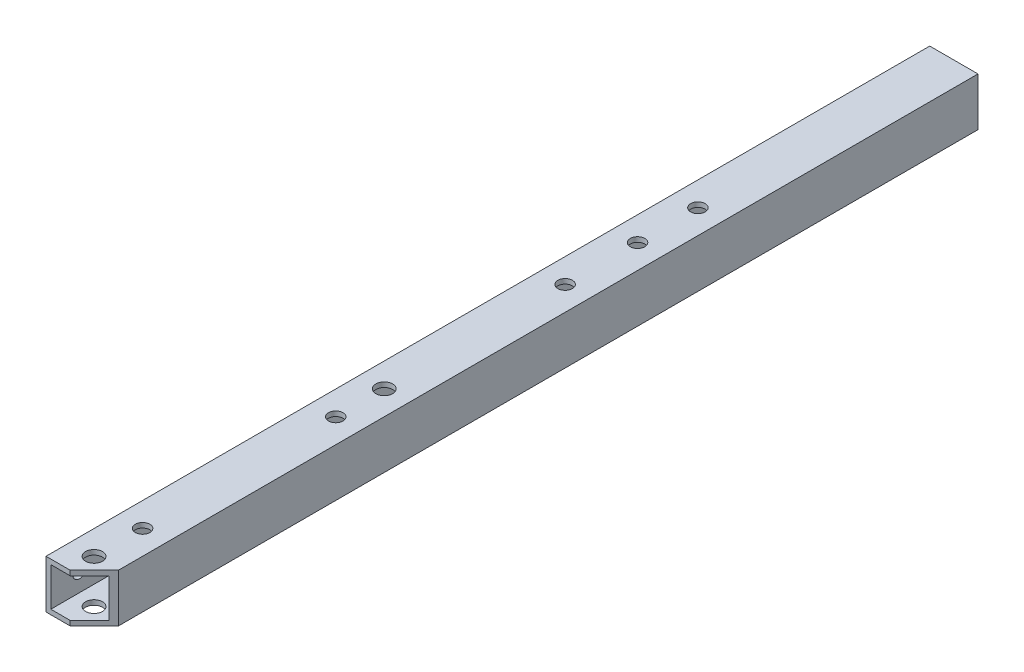
ISO-10303-21;
HEADER;
FILE_DESCRIPTION(('STEP AP214'),'2;1');
FILE_NAME('part.step','',(''),(''),'','','');
FILE_SCHEMA(('AUTOMOTIVE_DESIGN { 1 0 10303 214 1 1 1 1 }'));
ENDSEC;
DATA;
#1=APPLICATION_CONTEXT('core data for automotive mechanical design processes');
#2=APPLICATION_PROTOCOL_DEFINITION('international standard','automotive_design',2000,#1);
#3=PRODUCT_CONTEXT('',#1,'mechanical');
#4=PRODUCT('Part','Part','',(#3));
#5=PRODUCT_RELATED_PRODUCT_CATEGORY('part','',(#4));
#6=PRODUCT_DEFINITION_FORMATION('','',#4);
#7=PRODUCT_DEFINITION_CONTEXT('part definition',#1,'design');
#8=PRODUCT_DEFINITION('design','',#6,#7);
#9=PRODUCT_DEFINITION_SHAPE('','',#8);
#10=(LENGTH_UNIT() NAMED_UNIT(*) SI_UNIT(.MILLI.,.METRE.));
#11=(NAMED_UNIT(*) PLANE_ANGLE_UNIT() SI_UNIT($,.RADIAN.));
#12=(NAMED_UNIT(*) SI_UNIT($,.STERADIAN.) SOLID_ANGLE_UNIT());
#13=UNCERTAINTY_MEASURE_WITH_UNIT(LENGTH_MEASURE(1.E-05),#10,'distance_accuracy_value','');
#14=(GEOMETRIC_REPRESENTATION_CONTEXT(3) GLOBAL_UNCERTAINTY_ASSIGNED_CONTEXT((#13)) GLOBAL_UNIT_ASSIGNED_CONTEXT((#10,
#11,#12)) REPRESENTATION_CONTEXT('',''));
#15=CARTESIAN_POINT('',(0.,0.,0.));
#16=DIRECTION('',(0.,0.,1.));
#17=DIRECTION('',(1.,0.,0.));
#18=AXIS2_PLACEMENT_3D('',#15,#16,#17);
#19=CARTESIAN_POINT('',(-5.,-5.,183.));
#20=DIRECTION('',(0.,1.,0.));
#21=DIRECTION('',(0.,0.,1.));
#22=AXIS2_PLACEMENT_3D('',#19,#20,#21);
#23=PLANE('',#22);
#24=CARTESIAN_POINT('',(0.,-5.,53.));
#25=DIRECTION('',(0.,1.,0.));
#26=DIRECTION('',(0.,0.,1.));
#27=AXIS2_PLACEMENT_3D('',#24,#25,#26);
#28=CIRCLE('',#27,1.5);
#29=CARTESIAN_POINT('',(0.,-5.,54.5));
#30=VERTEX_POINT('',#29);
#31=EDGE_CURVE('E361',#30,#30,#28,.T.);
#32=ORIENTED_EDGE('',*,*,#31,.T.);
#33=EDGE_LOOP('',(#32));
#34=FACE_BOUND('',#33,.T.);
#35=CARTESIAN_POINT('',(0.,-5.,65.5));
#36=DIRECTION('',(0.,1.,0.));
#37=DIRECTION('',(0.,0.,1.));
#38=AXIS2_PLACEMENT_3D('',#35,#36,#37);
#39=CIRCLE('',#38,1.5);
#40=CARTESIAN_POINT('',(0.,-5.,67.));
#41=VERTEX_POINT('',#40);
#42=EDGE_CURVE('E355',#41,#41,#39,.T.);
#43=ORIENTED_EDGE('',*,*,#42,.T.);
#44=EDGE_LOOP('',(#43));
#45=FACE_BOUND('',#44,.T.);
#46=CARTESIAN_POINT('',(0.,-5.,80.5));
#47=DIRECTION('',(0.,1.,0.));
#48=DIRECTION('',(0.,0.,1.));
#49=AXIS2_PLACEMENT_3D('',#46,#47,#48);
#50=CIRCLE('',#49,1.5);
#51=CARTESIAN_POINT('',(0.,-5.,82.));
#52=VERTEX_POINT('',#51);
#53=EDGE_CURVE('E349',#52,#52,#50,.T.);
#54=ORIENTED_EDGE('',*,*,#53,.T.);
#55=EDGE_LOOP('',(#54));
#56=FACE_BOUND('',#55,.T.);
#57=CARTESIAN_POINT('',(0.,-5.,117.947961799572));
#58=DIRECTION('',(0.,1.,0.));
#59=DIRECTION('',(0.,0.,1.));
#60=AXIS2_PLACEMENT_3D('',#57,#58,#59);
#61=CIRCLE('',#60,1.75000000000001);
#62=CARTESIAN_POINT('',(0.,-5.,119.697961799572));
#63=VERTEX_POINT('',#62);
#64=EDGE_CURVE('E343',#63,#63,#61,.T.);
#65=ORIENTED_EDGE('',*,*,#64,.T.);
#66=EDGE_LOOP('',(#65));
#67=FACE_BOUND('',#66,.T.);
#68=CARTESIAN_POINT('',(0.,-5.,128.));
#69=DIRECTION('',(0.,1.,0.));
#70=DIRECTION('',(0.,0.,1.));
#71=AXIS2_PLACEMENT_3D('',#68,#69,#70);
#72=CIRCLE('',#71,1.5);
#73=CARTESIAN_POINT('',(0.,-5.,129.5));
#74=VERTEX_POINT('',#73);
#75=EDGE_CURVE('E335',#74,#74,#72,.T.);
#76=ORIENTED_EDGE('',*,*,#75,.T.);
#77=EDGE_LOOP('',(#76));
#78=FACE_BOUND('',#77,.T.);
#79=DIRECTION('',(0.,0.,-1.));
#80=VECTOR('',#79,1.);
#81=CARTESIAN_POINT('',(4.99999999999999,-5.,183.));
#82=LINE('',#81,#80);
#83=CARTESIAN_POINT('',(4.99999999999999,-5.,178.));
#84=VERTEX_POINT('',#83);
#85=CARTESIAN_POINT('',(4.99999999999999,-5.,0.));
#86=VERTEX_POINT('',#85);
#87=EDGE_CURVE('E174',#84,#86,#82,.T.);
#88=ORIENTED_EDGE('',*,*,#87,.F.);
#89=DIRECTION('',(-0.707106781186547,0.,0.707106781186549));
#90=VECTOR('',#89,1.);
#91=CARTESIAN_POINT('',(91.5,-5.,91.4999999999997));
#92=LINE('',#91,#90);
#93=CARTESIAN_POINT('',(0.,-5.,183.));
#94=VERTEX_POINT('',#93);
#95=EDGE_CURVE('E158',#84,#94,#92,.T.);
#96=ORIENTED_EDGE('',*,*,#95,.T.);
#97=DIRECTION('',(1.,0.,0.));
#98=VECTOR('',#97,1.);
#99=CARTESIAN_POINT('',(-5.,-5.,183.));
#100=LINE('',#99,#98);
#101=CARTESIAN_POINT('',(-5.,-5.,183.));
#102=VERTEX_POINT('',#101);
#103=EDGE_CURVE('E255',#102,#94,#100,.T.);
#104=ORIENTED_EDGE('',*,*,#103,.F.);
#105=DIRECTION('',(0.,0.,-1.));
#106=VECTOR('',#105,1.);
#107=CARTESIAN_POINT('',(-5.,-5.,183.));
#108=LINE('',#107,#106);
#109=CARTESIAN_POINT('',(-5.,-5.,0.));
#110=VERTEX_POINT('',#109);
#111=EDGE_CURVE('E89',#102,#110,#108,.T.);
#112=ORIENTED_EDGE('',*,*,#111,.T.);
#113=DIRECTION('',(1.,0.,0.));
#114=VECTOR('',#113,1.);
#115=CARTESIAN_POINT('',(-5.,-5.,0.));
#116=LINE('',#115,#114);
#117=EDGE_CURVE('E180',#110,#86,#116,.T.);
#118=ORIENTED_EDGE('',*,*,#117,.T.);
#119=EDGE_LOOP('',(#88,#96,#104,#112,#118));
#120=FACE_BOUND('',#119,.T.);
#121=CARTESIAN_POINT('',(0.,-5.,178.052038200428));
#122=DIRECTION('',(0.,1.,0.));
#123=DIRECTION('',(0.,0.,1.));
#124=AXIS2_PLACEMENT_3D('',#121,#122,#123);
#125=CIRCLE('',#124,1.75000000000001);
#126=CARTESIAN_POINT('',(0.,-5.,179.802038200428));
#127=VERTEX_POINT('',#126);
#128=EDGE_CURVE('E282',#127,#127,#125,.F.);
#129=ORIENTED_EDGE('',*,*,#128,.F.);
#130=EDGE_LOOP('',(#129));
#131=FACE_BOUND('',#130,.T.);
#132=CARTESIAN_POINT('',(0.,-5.,168.));
#133=DIRECTION('',(0.,1.,0.));
#134=DIRECTION('',(0.,0.,1.));
#135=AXIS2_PLACEMENT_3D('',#132,#133,#134);
#136=CIRCLE('',#135,1.5);
#137=CARTESIAN_POINT('',(0.,-5.,169.5));
#138=VERTEX_POINT('',#137);
#139=EDGE_CURVE('E328',#138,#138,#136,.F.);
#140=ORIENTED_EDGE('',*,*,#139,.F.);
#141=EDGE_LOOP('',(#140));
#142=FACE_BOUND('',#141,.T.);
#143=ADVANCED_FACE('F80',(#34,#45,#56,#67,#78,#120,#131,#142),#23,.F.);
#144=CARTESIAN_POINT('',(-5.,5.,183.));
#145=DIRECTION('',(0.,-1.,0.));
#146=DIRECTION('',(0.,0.,-1.));
#147=AXIS2_PLACEMENT_3D('',#144,#145,#146);
#148=PLANE('',#147);
#149=CARTESIAN_POINT('',(0.,5.,53.));
#150=DIRECTION('',(0.,1.,0.));
#151=DIRECTION('',(0.,0.,1.));
#152=AXIS2_PLACEMENT_3D('',#149,#150,#151);
#153=CIRCLE('',#152,1.5);
#154=CARTESIAN_POINT('',(0.,5.,54.5));
#155=VERTEX_POINT('',#154);
#156=EDGE_CURVE('E363',#155,#155,#153,.T.);
#157=ORIENTED_EDGE('',*,*,#156,.F.);
#158=EDGE_LOOP('',(#157));
#159=FACE_BOUND('',#158,.T.);
#160=CARTESIAN_POINT('',(0.,5.,65.5));
#161=DIRECTION('',(0.,1.,0.));
#162=DIRECTION('',(0.,0.,1.));
#163=AXIS2_PLACEMENT_3D('',#160,#161,#162);
#164=CIRCLE('',#163,1.5);
#165=CARTESIAN_POINT('',(0.,5.,67.));
#166=VERTEX_POINT('',#165);
#167=EDGE_CURVE('E358',#166,#166,#164,.T.);
#168=ORIENTED_EDGE('',*,*,#167,.F.);
#169=EDGE_LOOP('',(#168));
#170=FACE_BOUND('',#169,.T.);
#171=CARTESIAN_POINT('',(0.,5.,80.5));
#172=DIRECTION('',(0.,1.,0.));
#173=DIRECTION('',(0.,0.,1.));
#174=AXIS2_PLACEMENT_3D('',#171,#172,#173);
#175=CIRCLE('',#174,1.5);
#176=CARTESIAN_POINT('',(0.,5.,82.));
#177=VERTEX_POINT('',#176);
#178=EDGE_CURVE('E352',#177,#177,#175,.T.);
#179=ORIENTED_EDGE('',*,*,#178,.F.);
#180=EDGE_LOOP('',(#179));
#181=FACE_BOUND('',#180,.T.);
#182=CARTESIAN_POINT('',(0.,5.,117.947961799572));
#183=DIRECTION('',(0.,1.,0.));
#184=DIRECTION('',(0.,0.,1.));
#185=AXIS2_PLACEMENT_3D('',#182,#183,#184);
#186=CIRCLE('',#185,1.75000000000001);
#187=CARTESIAN_POINT('',(0.,5.,119.697961799572));
#188=VERTEX_POINT('',#187);
#189=EDGE_CURVE('E346',#188,#188,#186,.T.);
#190=ORIENTED_EDGE('',*,*,#189,.F.);
#191=EDGE_LOOP('',(#190));
#192=FACE_BOUND('',#191,.T.);
#193=CARTESIAN_POINT('',(0.,5.,128.));
#194=DIRECTION('',(0.,1.,0.));
#195=DIRECTION('',(0.,0.,1.));
#196=AXIS2_PLACEMENT_3D('',#193,#194,#195);
#197=CIRCLE('',#196,1.5);
#198=CARTESIAN_POINT('',(0.,5.,129.5));
#199=VERTEX_POINT('',#198);
#200=EDGE_CURVE('E340',#199,#199,#197,.T.);
#201=ORIENTED_EDGE('',*,*,#200,.F.);
#202=EDGE_LOOP('',(#201));
#203=FACE_BOUND('',#202,.T.);
#204=DIRECTION('',(-1.,0.,0.));
#205=VECTOR('',#204,1.);
#206=CARTESIAN_POINT('',(-5.,5.,183.));
#207=LINE('',#206,#205);
#208=CARTESIAN_POINT('',(0.,5.,183.));
#209=VERTEX_POINT('',#208);
#210=CARTESIAN_POINT('',(-5.,5.,183.));
#211=VERTEX_POINT('',#210);
#212=EDGE_CURVE('E258',#209,#211,#207,.T.);
#213=ORIENTED_EDGE('',*,*,#212,.F.);
#214=DIRECTION('',(-0.707106781186547,0.,0.707106781186549));
#215=VECTOR('',#214,1.);
#216=CARTESIAN_POINT('',(91.5,5.,91.4999999999997));
#217=LINE('',#216,#215);
#218=CARTESIAN_POINT('',(4.99999999999999,5.,178.));
#219=VERTEX_POINT('',#218);
#220=EDGE_CURVE('E168',#219,#209,#217,.T.);
#221=ORIENTED_EDGE('',*,*,#220,.F.);
#222=DIRECTION('',(0.,0.,-1.));
#223=VECTOR('',#222,1.);
#224=CARTESIAN_POINT('',(4.99999999999999,5.,183.));
#225=LINE('',#224,#223);
#226=CARTESIAN_POINT('',(4.99999999999999,5.,0.));
#227=VERTEX_POINT('',#226);
#228=EDGE_CURVE('E176',#219,#227,#225,.T.);
#229=ORIENTED_EDGE('',*,*,#228,.T.);
#230=DIRECTION('',(-1.,0.,0.));
#231=VECTOR('',#230,1.);
#232=CARTESIAN_POINT('',(-5.,5.,0.));
#233=LINE('',#232,#231);
#234=CARTESIAN_POINT('',(-5.,5.,0.));
#235=VERTEX_POINT('',#234);
#236=EDGE_CURVE('E256',#227,#235,#233,.T.);
#237=ORIENTED_EDGE('',*,*,#236,.T.);
#238=DIRECTION('',(0.,0.,-1.));
#239=VECTOR('',#238,1.);
#240=CARTESIAN_POINT('',(-5.,5.,183.));
#241=LINE('',#240,#239);
#242=EDGE_CURVE('E184',#211,#235,#241,.T.);
#243=ORIENTED_EDGE('',*,*,#242,.F.);
#244=EDGE_LOOP('',(#213,#221,#229,#237,#243));
#245=FACE_BOUND('',#244,.T.);
#246=CARTESIAN_POINT('',(0.,5.,178.052038200428));
#247=DIRECTION('',(0.,1.,0.));
#248=DIRECTION('',(0.,0.,1.));
#249=AXIS2_PLACEMENT_3D('',#246,#247,#248);
#250=CIRCLE('',#249,1.75000000000001);
#251=CARTESIAN_POINT('',(0.,5.,179.802038200428));
#252=VERTEX_POINT('',#251);
#253=EDGE_CURVE('E285',#252,#252,#250,.F.);
#254=ORIENTED_EDGE('',*,*,#253,.T.);
#255=EDGE_LOOP('',(#254));
#256=FACE_BOUND('',#255,.T.);
#257=CARTESIAN_POINT('',(0.,5.,168.));
#258=DIRECTION('',(0.,1.,0.));
#259=DIRECTION('',(0.,0.,1.));
#260=AXIS2_PLACEMENT_3D('',#257,#258,#259);
#261=CIRCLE('',#260,1.5);
#262=CARTESIAN_POINT('',(0.,5.,169.5));
#263=VERTEX_POINT('',#262);
#264=EDGE_CURVE('E330',#263,#263,#261,.F.);
#265=ORIENTED_EDGE('',*,*,#264,.T.);
#266=EDGE_LOOP('',(#265));
#267=FACE_BOUND('',#266,.T.);
#268=ADVANCED_FACE('F280',(#159,#170,#181,#192,#203,#245,#256,#267),#148,.F.);
#269=CARTESIAN_POINT('',(-5.,-4.,183.));
#270=DIRECTION('',(0.,1.,0.));
#271=DIRECTION('',(0.,0.,1.));
#272=AXIS2_PLACEMENT_3D('',#269,#270,#271);
#273=PLANE('',#272);
#274=CARTESIAN_POINT('',(0.,-4.,53.));
#275=DIRECTION('',(0.,1.,0.));
#276=DIRECTION('',(0.,0.,1.));
#277=AXIS2_PLACEMENT_3D('',#274,#275,#276);
#278=CIRCLE('',#277,1.5);
#279=CARTESIAN_POINT('',(0.,-4.,54.5));
#280=VERTEX_POINT('',#279);
#281=EDGE_CURVE('E214',#280,#280,#278,.T.);
#282=ORIENTED_EDGE('',*,*,#281,.F.);
#283=EDGE_LOOP('',(#282));
#284=FACE_BOUND('',#283,.T.);
#285=CARTESIAN_POINT('',(0.,-4.,65.5));
#286=DIRECTION('',(0.,1.,0.));
#287=DIRECTION('',(0.,0.,1.));
#288=AXIS2_PLACEMENT_3D('',#285,#286,#287);
#289=CIRCLE('',#288,1.5);
#290=CARTESIAN_POINT('',(0.,-4.,67.));
#291=VERTEX_POINT('',#290);
#292=EDGE_CURVE('E211',#291,#291,#289,.T.);
#293=ORIENTED_EDGE('',*,*,#292,.F.);
#294=EDGE_LOOP('',(#293));
#295=FACE_BOUND('',#294,.T.);
#296=CARTESIAN_POINT('',(0.,-4.,80.5));
#297=DIRECTION('',(0.,1.,0.));
#298=DIRECTION('',(0.,0.,1.));
#299=AXIS2_PLACEMENT_3D('',#296,#297,#298);
#300=CIRCLE('',#299,1.5);
#301=CARTESIAN_POINT('',(0.,-4.,82.));
#302=VERTEX_POINT('',#301);
#303=EDGE_CURVE('E208',#302,#302,#300,.T.);
#304=ORIENTED_EDGE('',*,*,#303,.F.);
#305=EDGE_LOOP('',(#304));
#306=FACE_BOUND('',#305,.T.);
#307=CARTESIAN_POINT('',(0.,-4.,117.947961799572));
#308=DIRECTION('',(0.,1.,0.));
#309=DIRECTION('',(0.,0.,1.));
#310=AXIS2_PLACEMENT_3D('',#307,#308,#309);
#311=CIRCLE('',#310,1.75000000000001);
#312=CARTESIAN_POINT('',(0.,-4.,119.697961799572));
#313=VERTEX_POINT('',#312);
#314=EDGE_CURVE('E204',#313,#313,#311,.T.);
#315=ORIENTED_EDGE('',*,*,#314,.F.);
#316=EDGE_LOOP('',(#315));
#317=FACE_BOUND('',#316,.T.);
#318=CARTESIAN_POINT('',(0.,-4.,128.));
#319=DIRECTION('',(0.,1.,0.));
#320=DIRECTION('',(0.,0.,1.));
#321=AXIS2_PLACEMENT_3D('',#318,#319,#320);
#322=CIRCLE('',#321,1.5);
#323=CARTESIAN_POINT('',(0.,-4.,129.5));
#324=VERTEX_POINT('',#323);
#325=EDGE_CURVE('E200',#324,#324,#322,.T.);
#326=ORIENTED_EDGE('',*,*,#325,.F.);
#327=EDGE_LOOP('',(#326));
#328=FACE_BOUND('',#327,.T.);
#329=CARTESIAN_POINT('',(0.,-4.,178.052038200428));
#330=DIRECTION('',(0.,1.,0.));
#331=DIRECTION('',(0.,0.,1.));
#332=AXIS2_PLACEMENT_3D('',#329,#330,#331);
#333=CIRCLE('',#332,1.75000000000001);
#334=CARTESIAN_POINT('',(0.,-4.,179.802038200428));
#335=VERTEX_POINT('',#334);
#336=EDGE_CURVE('E191',#335,#335,#333,.F.);
#337=ORIENTED_EDGE('',*,*,#336,.T.);
#338=EDGE_LOOP('',(#337));
#339=FACE_BOUND('',#338,.T.);
#340=DIRECTION('',(-0.707106781186547,0.,0.707106781186549));
#341=VECTOR('',#340,1.);
#342=CARTESIAN_POINT('',(-2.49999999999998,-4.,185.5));
#343=LINE('',#342,#341);
#344=CARTESIAN_POINT('',(3.99999999999999,-4.00000000000001,179.));
#345=VERTEX_POINT('',#344);
#346=CARTESIAN_POINT('',(0.,-4.,183.));
#347=VERTEX_POINT('',#346);
#348=EDGE_CURVE('E192',#345,#347,#343,.T.);
#349=ORIENTED_EDGE('',*,*,#348,.F.);
#350=DIRECTION('',(0.,0.,-1.));
#351=VECTOR('',#350,1.);
#352=CARTESIAN_POINT('',(3.99999999999999,-4.,183.));
#353=LINE('',#352,#351);
#354=CARTESIAN_POINT('',(3.99999999999999,-4.,0.));
#355=VERTEX_POINT('',#354);
#356=EDGE_CURVE('E247',#345,#355,#353,.T.);
#357=ORIENTED_EDGE('',*,*,#356,.T.);
#358=DIRECTION('',(1.,0.,0.));
#359=VECTOR('',#358,1.);
#360=CARTESIAN_POINT('',(-5.,-4.,0.));
#361=LINE('',#360,#359);
#362=CARTESIAN_POINT('',(-4.,-4.,0.));
#363=VERTEX_POINT('',#362);
#364=EDGE_CURVE('E236',#363,#355,#361,.T.);
#365=ORIENTED_EDGE('',*,*,#364,.F.);
#366=DIRECTION('',(0.,0.,-1.));
#367=VECTOR('',#366,1.);
#368=CARTESIAN_POINT('',(-4.,-4.,183.));
#369=LINE('',#368,#367);
#370=CARTESIAN_POINT('',(-4.,-4.,183.));
#371=VERTEX_POINT('',#370);
#372=EDGE_CURVE('E249',#371,#363,#369,.T.);
#373=ORIENTED_EDGE('',*,*,#372,.F.);
#374=DIRECTION('',(1.,0.,0.));
#375=VECTOR('',#374,1.);
#376=CARTESIAN_POINT('',(-5.,-4.,183.));
#377=LINE('',#376,#375);
#378=EDGE_CURVE('E228',#371,#347,#377,.T.);
#379=ORIENTED_EDGE('',*,*,#378,.T.);
#380=EDGE_LOOP('',(#349,#357,#365,#373,#379));
#381=FACE_BOUND('',#380,.T.);
#382=CARTESIAN_POINT('',(0.,-4.,168.));
#383=DIRECTION('',(0.,1.,0.));
#384=DIRECTION('',(0.,0.,1.));
#385=AXIS2_PLACEMENT_3D('',#382,#383,#384);
#386=CIRCLE('',#385,1.5);
#387=CARTESIAN_POINT('',(0.,-4.,169.5));
#388=VERTEX_POINT('',#387);
#389=EDGE_CURVE('E196',#388,#388,#386,.F.);
#390=ORIENTED_EDGE('',*,*,#389,.T.);
#391=EDGE_LOOP('',(#390));
#392=FACE_BOUND('',#391,.T.);
#393=ADVANCED_FACE('F304',(#284,#295,#306,#317,#328,#339,#381,#392),#273,.T.);
#394=CARTESIAN_POINT('',(-5.,4.,183.));
#395=DIRECTION('',(0.,-1.,0.));
#396=DIRECTION('',(0.,0.,-1.));
#397=AXIS2_PLACEMENT_3D('',#394,#395,#396);
#398=PLANE('',#397);
#399=CARTESIAN_POINT('',(0.,4.,53.));
#400=DIRECTION('',(0.,-1.,0.));
#401=DIRECTION('',(0.,0.,-1.));
#402=AXIS2_PLACEMENT_3D('',#399,#400,#401);
#403=CIRCLE('',#402,1.5);
#404=CARTESIAN_POINT('',(0.,4.,51.5));
#405=VERTEX_POINT('',#404);
#406=EDGE_CURVE('E212',#405,#405,#403,.T.);
#407=ORIENTED_EDGE('',*,*,#406,.F.);
#408=EDGE_LOOP('',(#407));
#409=FACE_BOUND('',#408,.T.);
#410=CARTESIAN_POINT('',(0.,4.,65.5));
#411=DIRECTION('',(0.,-1.,0.));
#412=DIRECTION('',(0.,0.,-1.));
#413=AXIS2_PLACEMENT_3D('',#410,#411,#412);
#414=CIRCLE('',#413,1.5);
#415=CARTESIAN_POINT('',(0.,4.,64.));
#416=VERTEX_POINT('',#415);
#417=EDGE_CURVE('E209',#416,#416,#414,.T.);
#418=ORIENTED_EDGE('',*,*,#417,.F.);
#419=EDGE_LOOP('',(#418));
#420=FACE_BOUND('',#419,.T.);
#421=CARTESIAN_POINT('',(0.,4.,80.5));
#422=DIRECTION('',(0.,-1.,0.));
#423=DIRECTION('',(0.,0.,-1.));
#424=AXIS2_PLACEMENT_3D('',#421,#422,#423);
#425=CIRCLE('',#424,1.5);
#426=CARTESIAN_POINT('',(0.,4.,79.));
#427=VERTEX_POINT('',#426);
#428=EDGE_CURVE('E205',#427,#427,#425,.T.);
#429=ORIENTED_EDGE('',*,*,#428,.F.);
#430=EDGE_LOOP('',(#429));
#431=FACE_BOUND('',#430,.T.);
#432=CARTESIAN_POINT('',(0.,4.,117.947961799572));
#433=DIRECTION('',(0.,-1.,0.));
#434=DIRECTION('',(0.,0.,-1.));
#435=AXIS2_PLACEMENT_3D('',#432,#433,#434);
#436=CIRCLE('',#435,1.75000000000001);
#437=CARTESIAN_POINT('',(0.,4.,116.197961799572));
#438=VERTEX_POINT('',#437);
#439=EDGE_CURVE('E201',#438,#438,#436,.T.);
#440=ORIENTED_EDGE('',*,*,#439,.F.);
#441=EDGE_LOOP('',(#440));
#442=FACE_BOUND('',#441,.T.);
#443=CARTESIAN_POINT('',(0.,4.,128.));
#444=DIRECTION('',(0.,-1.,0.));
#445=DIRECTION('',(0.,0.,-1.));
#446=AXIS2_PLACEMENT_3D('',#443,#444,#445);
#447=CIRCLE('',#446,1.5);
#448=CARTESIAN_POINT('',(0.,4.,126.5));
#449=VERTEX_POINT('',#448);
#450=EDGE_CURVE('E197',#449,#449,#447,.T.);
#451=ORIENTED_EDGE('',*,*,#450,.F.);
#452=EDGE_LOOP('',(#451));
#453=FACE_BOUND('',#452,.T.);
#454=CARTESIAN_POINT('',(0.,4.,178.052038200428));
#455=DIRECTION('',(0.,-1.,0.));
#456=DIRECTION('',(0.,0.,-1.));
#457=AXIS2_PLACEMENT_3D('',#454,#455,#456);
#458=CIRCLE('',#457,1.75000000000001);
#459=CARTESIAN_POINT('',(0.,4.,176.302038200428));
#460=VERTEX_POINT('',#459);
#461=EDGE_CURVE('E188',#460,#460,#458,.F.);
#462=ORIENTED_EDGE('',*,*,#461,.T.);
#463=EDGE_LOOP('',(#462));
#464=FACE_BOUND('',#463,.T.);
#465=DIRECTION('',(0.707106781186547,0.,-0.707106781186549));
#466=VECTOR('',#465,1.);
#467=CARTESIAN_POINT('',(-2.49999999999998,4.,185.5));
#468=LINE('',#467,#466);
#469=CARTESIAN_POINT('',(0.,4.,183.));
#470=VERTEX_POINT('',#469);
#471=CARTESIAN_POINT('',(3.99999999999999,4.,179.));
#472=VERTEX_POINT('',#471);
#473=EDGE_CURVE('E12',#470,#472,#468,.T.);
#474=ORIENTED_EDGE('',*,*,#473,.F.);
#475=DIRECTION('',(-1.,0.,0.));
#476=VECTOR('',#475,1.);
#477=CARTESIAN_POINT('',(-5.,4.,183.));
#478=LINE('',#477,#476);
#479=CARTESIAN_POINT('',(-4.,4.,183.));
#480=VERTEX_POINT('',#479);
#481=EDGE_CURVE('E232',#470,#480,#478,.T.);
#482=ORIENTED_EDGE('',*,*,#481,.T.);
#483=DIRECTION('',(0.,0.,-1.));
#484=VECTOR('',#483,1.);
#485=CARTESIAN_POINT('',(-4.,4.,183.));
#486=LINE('',#485,#484);
#487=CARTESIAN_POINT('',(-4.,4.,0.));
#488=VERTEX_POINT('',#487);
#489=EDGE_CURVE('E234',#480,#488,#486,.T.);
#490=ORIENTED_EDGE('',*,*,#489,.T.);
#491=DIRECTION('',(-1.,0.,0.));
#492=VECTOR('',#491,1.);
#493=CARTESIAN_POINT('',(-5.,4.,0.));
#494=LINE('',#493,#492);
#495=CARTESIAN_POINT('',(3.99999999999999,4.,0.));
#496=VERTEX_POINT('',#495);
#497=EDGE_CURVE('E229',#496,#488,#494,.T.);
#498=ORIENTED_EDGE('',*,*,#497,.F.);
#499=DIRECTION('',(0.,0.,-1.));
#500=VECTOR('',#499,1.);
#501=CARTESIAN_POINT('',(3.99999999999999,4.,183.));
#502=LINE('',#501,#500);
#503=EDGE_CURVE('E245',#472,#496,#502,.T.);
#504=ORIENTED_EDGE('',*,*,#503,.F.);
#505=EDGE_LOOP('',(#474,#482,#490,#498,#504));
#506=FACE_BOUND('',#505,.T.);
#507=CARTESIAN_POINT('',(0.,4.,168.));
#508=DIRECTION('',(0.,-1.,0.));
#509=DIRECTION('',(0.,0.,-1.));
#510=AXIS2_PLACEMENT_3D('',#507,#508,#509);
#511=CIRCLE('',#510,1.5);
#512=CARTESIAN_POINT('',(0.,4.,166.5));
#513=VERTEX_POINT('',#512);
#514=EDGE_CURVE('E193',#513,#513,#511,.F.);
#515=ORIENTED_EDGE('',*,*,#514,.T.);
#516=EDGE_LOOP('',(#515));
#517=FACE_BOUND('',#516,.T.);
#518=ADVANCED_FACE('F307',(#409,#420,#431,#442,#453,#464,#506,#517),#398,.T.);
#519=CARTESIAN_POINT('',(0.,0.,183.));
#520=DIRECTION('',(0.,0.,1.));
#521=DIRECTION('',(1.,0.,0.));
#522=AXIS2_PLACEMENT_3D('',#519,#520,#521);
#523=PLANE('',#522);
#524=DIRECTION('',(0.,1.,0.));
#525=VECTOR('',#524,1.);
#526=CARTESIAN_POINT('',(0.,-5.,183.));
#527=LINE('',#526,#525);
#528=EDGE_CURVE('E96',#470,#209,#527,.T.);
#529=ORIENTED_EDGE('',*,*,#528,.T.);
#530=ORIENTED_EDGE('',*,*,#212,.T.);
#531=DIRECTION('',(0.,-1.,0.));
#532=VECTOR('',#531,1.);
#533=CARTESIAN_POINT('',(-5.,5.,183.));
#534=LINE('',#533,#532);
#535=EDGE_CURVE('E252',#211,#102,#534,.T.);
#536=ORIENTED_EDGE('',*,*,#535,.T.);
#537=ORIENTED_EDGE('',*,*,#103,.T.);
#538=EDGE_CURVE('E164',#94,#347,#527,.T.);
#539=ORIENTED_EDGE('',*,*,#538,.T.);
#540=ORIENTED_EDGE('',*,*,#378,.F.);
#541=DIRECTION('',(0.,-1.,0.));
#542=VECTOR('',#541,1.);
#543=CARTESIAN_POINT('',(-4.,5.,183.));
#544=LINE('',#543,#542);
#545=EDGE_CURVE('E226',#480,#371,#544,.T.);
#546=ORIENTED_EDGE('',*,*,#545,.F.);
#547=ORIENTED_EDGE('',*,*,#481,.F.);
#548=EDGE_LOOP('',(#529,#530,#536,#537,#539,#540,#546,#547));
#549=FACE_BOUND('',#548,.T.);
#550=ADVANCED_FACE('F278',(#549),#523,.T.);
#551=CARTESIAN_POINT('',(0.,0.,0.));
#552=DIRECTION('',(0.,0.,1.));
#553=DIRECTION('',(1.,0.,0.));
#554=AXIS2_PLACEMENT_3D('',#551,#552,#553);
#555=PLANE('',#554);
#556=DIRECTION('',(0.,-1.,0.));
#557=VECTOR('',#556,1.);
#558=CARTESIAN_POINT('',(-5.,5.,0.));
#559=LINE('',#558,#557);
#560=EDGE_CURVE('E251',#235,#110,#559,.T.);
#561=ORIENTED_EDGE('',*,*,#560,.F.);
#562=ORIENTED_EDGE('',*,*,#236,.F.);
#563=DIRECTION('',(0.,1.,0.));
#564=VECTOR('',#563,1.);
#565=CARTESIAN_POINT('',(4.99999999999999,5.,0.));
#566=LINE('',#565,#564);
#567=EDGE_CURVE('E263',#86,#227,#566,.T.);
#568=ORIENTED_EDGE('',*,*,#567,.F.);
#569=ORIENTED_EDGE('',*,*,#117,.F.);
#570=EDGE_LOOP('',(#561,#562,#568,#569));
#571=FACE_BOUND('',#570,.T.);
#572=DIRECTION('',(0.,-1.,0.));
#573=VECTOR('',#572,1.);
#574=CARTESIAN_POINT('',(-4.,5.,0.));
#575=LINE('',#574,#573);
#576=EDGE_CURVE('E104',#488,#363,#575,.T.);
#577=ORIENTED_EDGE('',*,*,#576,.T.);
#578=ORIENTED_EDGE('',*,*,#364,.T.);
#579=DIRECTION('',(0.,1.,0.));
#580=VECTOR('',#579,1.);
#581=CARTESIAN_POINT('',(3.99999999999999,5.,0.));
#582=LINE('',#581,#580);
#583=EDGE_CURVE('E239',#355,#496,#582,.T.);
#584=ORIENTED_EDGE('',*,*,#583,.T.);
#585=ORIENTED_EDGE('',*,*,#497,.T.);
#586=EDGE_LOOP('',(#577,#578,#584,#585));
#587=FACE_BOUND('',#586,.T.);
#588=ADVANCED_FACE('F275',(#571,#587),#555,.F.);
#589=CARTESIAN_POINT('',(-5.,5.,183.));
#590=DIRECTION('',(1.,0.,0.));
#591=DIRECTION('',(0.,0.,-1.));
#592=AXIS2_PLACEMENT_3D('',#589,#590,#591);
#593=PLANE('',#592);
#594=CARTESIAN_POINT('',(-5.,0.,177.));
#595=DIRECTION('',(-1.,0.,0.));
#596=DIRECTION('',(0.,0.,1.));
#597=AXIS2_PLACEMENT_3D('',#594,#595,#596);
#598=CIRCLE('',#597,1.5);
#599=CARTESIAN_POINT('',(-5.,0.,178.5));
#600=VERTEX_POINT('',#599);
#601=EDGE_CURVE('E368',#600,#600,#598,.T.);
#602=ORIENTED_EDGE('',*,*,#601,.F.);
#603=EDGE_LOOP('',(#602));
#604=FACE_BOUND('',#603,.T.);
#605=ORIENTED_EDGE('',*,*,#560,.T.);
#606=ORIENTED_EDGE('',*,*,#111,.F.);
#607=ORIENTED_EDGE('',*,*,#535,.F.);
#608=ORIENTED_EDGE('',*,*,#242,.T.);
#609=EDGE_LOOP('',(#605,#606,#607,#608));
#610=FACE_BOUND('',#609,.T.);
#611=ADVANCED_FACE('F82',(#604,#610),#593,.F.);
#612=CARTESIAN_POINT('',(4.99999999999999,5.,183.));
#613=DIRECTION('',(-1.,0.,0.));
#614=DIRECTION('',(0.,0.,1.));
#615=AXIS2_PLACEMENT_3D('',#612,#613,#614);
#616=PLANE('',#615);
#617=ORIENTED_EDGE('',*,*,#228,.F.);
#618=DIRECTION('',(0.,1.,0.));
#619=VECTOR('',#618,1.);
#620=CARTESIAN_POINT('',(4.99999999999999,-5.,178.));
#621=LINE('',#620,#619);
#622=EDGE_CURVE('E161',#84,#219,#621,.T.);
#623=ORIENTED_EDGE('',*,*,#622,.F.);
#624=ORIENTED_EDGE('',*,*,#87,.T.);
#625=ORIENTED_EDGE('',*,*,#567,.T.);
#626=EDGE_LOOP('',(#617,#623,#624,#625));
#627=FACE_BOUND('',#626,.T.);
#628=ADVANCED_FACE('F172',(#627),#616,.F.);
#629=CARTESIAN_POINT('',(-4.,5.,183.));
#630=DIRECTION('',(1.,0.,0.));
#631=DIRECTION('',(0.,0.,-1.));
#632=AXIS2_PLACEMENT_3D('',#629,#630,#631);
#633=PLANE('',#632);
#634=CARTESIAN_POINT('',(-4.,0.,177.));
#635=DIRECTION('',(1.,0.,0.));
#636=DIRECTION('',(0.,0.,-1.));
#637=AXIS2_PLACEMENT_3D('',#634,#635,#636);
#638=CIRCLE('',#637,1.5);
#639=CARTESIAN_POINT('',(-4.,0.,175.5));
#640=VERTEX_POINT('',#639);
#641=EDGE_CURVE('E84',#640,#640,#638,.T.);
#642=ORIENTED_EDGE('',*,*,#641,.F.);
#643=EDGE_LOOP('',(#642));
#644=FACE_BOUND('',#643,.T.);
#645=ORIENTED_EDGE('',*,*,#576,.F.);
#646=ORIENTED_EDGE('',*,*,#489,.F.);
#647=ORIENTED_EDGE('',*,*,#545,.T.);
#648=ORIENTED_EDGE('',*,*,#372,.T.);
#649=EDGE_LOOP('',(#645,#646,#647,#648));
#650=FACE_BOUND('',#649,.T.);
#651=ADVANCED_FACE('F382',(#644,#650),#633,.T.);
#652=CARTESIAN_POINT('',(3.99999999999999,5.,183.));
#653=DIRECTION('',(-1.,0.,0.));
#654=DIRECTION('',(0.,0.,1.));
#655=AXIS2_PLACEMENT_3D('',#652,#653,#654);
#656=PLANE('',#655);
#657=DIRECTION('',(0.,-1.,0.));
#658=VECTOR('',#657,1.);
#659=CARTESIAN_POINT('',(3.99999999999999,5.,179.));
#660=LINE('',#659,#658);
#661=EDGE_CURVE('E289',#472,#345,#660,.T.);
#662=ORIENTED_EDGE('',*,*,#661,.F.);
#663=ORIENTED_EDGE('',*,*,#503,.T.);
#664=ORIENTED_EDGE('',*,*,#583,.F.);
#665=ORIENTED_EDGE('',*,*,#356,.F.);
#666=EDGE_LOOP('',(#662,#663,#664,#665));
#667=FACE_BOUND('',#666,.T.);
#668=ADVANCED_FACE('F397',(#667),#656,.T.);
#669=CARTESIAN_POINT('',(91.5,-5.,91.4999999999997));
#670=DIRECTION('',(-0.707106781186548,0.,-0.707106781186546));
#671=DIRECTION('',(-0.707106781186547,0.,0.707106781186549));
#672=AXIS2_PLACEMENT_3D('',#669,#670,#671);
#673=PLANE('',#672);
#674=ORIENTED_EDGE('',*,*,#348,.T.);
#675=ORIENTED_EDGE('',*,*,#538,.F.);
#676=ORIENTED_EDGE('',*,*,#95,.F.);
#677=ORIENTED_EDGE('',*,*,#622,.T.);
#678=ORIENTED_EDGE('',*,*,#220,.T.);
#679=ORIENTED_EDGE('',*,*,#528,.F.);
#680=ORIENTED_EDGE('',*,*,#473,.T.);
#681=ORIENTED_EDGE('',*,*,#661,.T.);
#682=EDGE_LOOP('',(#674,#675,#676,#677,#678,#679,#680,#681));
#683=FACE_BOUND('',#682,.T.);
#684=ADVANCED_FACE('F160',(#683),#673,.F.);
#685=CARTESIAN_POINT('',(0.,-5.,178.052038200428));
#686=DIRECTION('',(0.,1.,0.));
#687=DIRECTION('',(0.,0.,1.));
#688=AXIS2_PLACEMENT_3D('',#685,#686,#687);
#689=CYLINDRICAL_SURFACE('',#688,1.75000000000001);
#690=ORIENTED_EDGE('',*,*,#461,.F.);
#691=EDGE_LOOP('',(#690));
#692=FACE_BOUND('',#691,.T.);
#693=ORIENTED_EDGE('',*,*,#253,.F.);
#694=EDGE_LOOP('',(#693));
#695=FACE_BOUND('',#694,.T.);
#696=ADVANCED_FACE('F408',(#692,#695),#689,.F.);
#697=CARTESIAN_POINT('',(0.,-5.,168.));
#698=DIRECTION('',(0.,1.,0.));
#699=DIRECTION('',(0.,0.,1.));
#700=AXIS2_PLACEMENT_3D('',#697,#698,#699);
#701=CYLINDRICAL_SURFACE('',#700,1.5);
#702=ORIENTED_EDGE('',*,*,#514,.F.);
#703=EDGE_LOOP('',(#702));
#704=FACE_BOUND('',#703,.T.);
#705=ORIENTED_EDGE('',*,*,#264,.F.);
#706=EDGE_LOOP('',(#705));
#707=FACE_BOUND('',#706,.T.);
#708=ADVANCED_FACE('F325',(#704,#707),#701,.F.);
#709=CARTESIAN_POINT('',(0.,-5.,128.));
#710=DIRECTION('',(0.,1.,0.));
#711=DIRECTION('',(0.,0.,1.));
#712=AXIS2_PLACEMENT_3D('',#709,#710,#711);
#713=CYLINDRICAL_SURFACE('',#712,1.5);
#714=ORIENTED_EDGE('',*,*,#450,.T.);
#715=EDGE_LOOP('',(#714));
#716=FACE_BOUND('',#715,.T.);
#717=ORIENTED_EDGE('',*,*,#200,.T.);
#718=EDGE_LOOP('',(#717));
#719=FACE_BOUND('',#718,.T.);
#720=ADVANCED_FACE('F426',(#716,#719),#713,.F.);
#721=CARTESIAN_POINT('',(0.,-5.,117.947961799572));
#722=DIRECTION('',(0.,1.,0.));
#723=DIRECTION('',(0.,0.,1.));
#724=AXIS2_PLACEMENT_3D('',#721,#722,#723);
#725=CYLINDRICAL_SURFACE('',#724,1.75000000000001);
#726=ORIENTED_EDGE('',*,*,#439,.T.);
#727=EDGE_LOOP('',(#726));
#728=FACE_BOUND('',#727,.T.);
#729=ORIENTED_EDGE('',*,*,#189,.T.);
#730=EDGE_LOOP('',(#729));
#731=FACE_BOUND('',#730,.T.);
#732=ADVANCED_FACE('F421',(#728,#731),#725,.F.);
#733=CARTESIAN_POINT('',(0.,-5.,80.5));
#734=DIRECTION('',(0.,1.,0.));
#735=DIRECTION('',(0.,0.,1.));
#736=AXIS2_PLACEMENT_3D('',#733,#734,#735);
#737=CYLINDRICAL_SURFACE('',#736,1.5);
#738=ORIENTED_EDGE('',*,*,#428,.T.);
#739=EDGE_LOOP('',(#738));
#740=FACE_BOUND('',#739,.T.);
#741=ORIENTED_EDGE('',*,*,#178,.T.);
#742=EDGE_LOOP('',(#741));
#743=FACE_BOUND('',#742,.T.);
#744=ADVANCED_FACE('F416',(#740,#743),#737,.F.);
#745=CARTESIAN_POINT('',(0.,-5.,65.5));
#746=DIRECTION('',(0.,1.,0.));
#747=DIRECTION('',(0.,0.,1.));
#748=AXIS2_PLACEMENT_3D('',#745,#746,#747);
#749=CYLINDRICAL_SURFACE('',#748,1.5);
#750=ORIENTED_EDGE('',*,*,#417,.T.);
#751=EDGE_LOOP('',(#750));
#752=FACE_BOUND('',#751,.T.);
#753=ORIENTED_EDGE('',*,*,#167,.T.);
#754=EDGE_LOOP('',(#753));
#755=FACE_BOUND('',#754,.T.);
#756=ADVANCED_FACE('F412',(#752,#755),#749,.F.);
#757=CARTESIAN_POINT('',(0.,-5.,53.));
#758=DIRECTION('',(0.,1.,0.));
#759=DIRECTION('',(0.,0.,1.));
#760=AXIS2_PLACEMENT_3D('',#757,#758,#759);
#761=CYLINDRICAL_SURFACE('',#760,1.5);
#762=ORIENTED_EDGE('',*,*,#406,.T.);
#763=EDGE_LOOP('',(#762));
#764=FACE_BOUND('',#763,.T.);
#765=ORIENTED_EDGE('',*,*,#156,.T.);
#766=EDGE_LOOP('',(#765));
#767=FACE_BOUND('',#766,.T.);
#768=ADVANCED_FACE('F409',(#764,#767),#761,.F.);
#769=ORIENTED_EDGE('',*,*,#336,.F.);
#770=EDGE_LOOP('',(#769));
#771=FACE_BOUND('',#770,.T.);
#772=ORIENTED_EDGE('',*,*,#128,.T.);
#773=EDGE_LOOP('',(#772));
#774=FACE_BOUND('',#773,.T.);
#775=ADVANCED_FACE('F323',(#771,#774),#689,.F.);
#776=ORIENTED_EDGE('',*,*,#389,.F.);
#777=EDGE_LOOP('',(#776));
#778=FACE_BOUND('',#777,.T.);
#779=ORIENTED_EDGE('',*,*,#139,.T.);
#780=EDGE_LOOP('',(#779));
#781=FACE_BOUND('',#780,.T.);
#782=ADVANCED_FACE('F319',(#778,#781),#701,.F.);
#783=ORIENTED_EDGE('',*,*,#325,.T.);
#784=EDGE_LOOP('',(#783));
#785=FACE_BOUND('',#784,.T.);
#786=ORIENTED_EDGE('',*,*,#75,.F.);
#787=EDGE_LOOP('',(#786));
#788=FACE_BOUND('',#787,.T.);
#789=ADVANCED_FACE('F322',(#785,#788),#713,.F.);
#790=ORIENTED_EDGE('',*,*,#314,.T.);
#791=EDGE_LOOP('',(#790));
#792=FACE_BOUND('',#791,.T.);
#793=ORIENTED_EDGE('',*,*,#64,.F.);
#794=EDGE_LOOP('',(#793));
#795=FACE_BOUND('',#794,.T.);
#796=ADVANCED_FACE('F301',(#792,#795),#725,.F.);
#797=ORIENTED_EDGE('',*,*,#303,.T.);
#798=EDGE_LOOP('',(#797));
#799=FACE_BOUND('',#798,.T.);
#800=ORIENTED_EDGE('',*,*,#53,.F.);
#801=EDGE_LOOP('',(#800));
#802=FACE_BOUND('',#801,.T.);
#803=ADVANCED_FACE('F423',(#799,#802),#737,.F.);
#804=ORIENTED_EDGE('',*,*,#292,.T.);
#805=EDGE_LOOP('',(#804));
#806=FACE_BOUND('',#805,.T.);
#807=ORIENTED_EDGE('',*,*,#42,.F.);
#808=EDGE_LOOP('',(#807));
#809=FACE_BOUND('',#808,.T.);
#810=ADVANCED_FACE('F418',(#806,#809),#749,.F.);
#811=ORIENTED_EDGE('',*,*,#281,.T.);
#812=EDGE_LOOP('',(#811));
#813=FACE_BOUND('',#812,.T.);
#814=ORIENTED_EDGE('',*,*,#31,.F.);
#815=EDGE_LOOP('',(#814));
#816=FACE_BOUND('',#815,.T.);
#817=ADVANCED_FACE('F413',(#813,#816),#761,.F.);
#818=CARTESIAN_POINT('',(0.,0.,177.));
#819=DIRECTION('',(-1.,0.,0.));
#820=DIRECTION('',(0.,0.,1.));
#821=AXIS2_PLACEMENT_3D('',#818,#819,#820);
#822=CYLINDRICAL_SURFACE('',#821,1.5);
#823=ORIENTED_EDGE('',*,*,#641,.T.);
#824=EDGE_LOOP('',(#823));
#825=FACE_BOUND('',#824,.T.);
#826=ORIENTED_EDGE('',*,*,#601,.T.);
#827=EDGE_LOOP('',(#826));
#828=FACE_BOUND('',#827,.T.);
#829=ADVANCED_FACE('F375',(#825,#828),#822,.F.);
#830=CLOSED_SHELL('',(#143,#268,#393,#518,#550,#588,#611,#628,#651,#668,#684,#696,#708,#720,
#732,#744,#756,#768,#775,#782,#789,#796,#803,#810,#817,#829));
#831=MANIFOLD_SOLID_BREP('B2',#830);
#832=ADVANCED_BREP_SHAPE_REPRESENTATION('',(#18,#831),#14);
#833=SHAPE_DEFINITION_REPRESENTATION(#9,#832);
ENDSEC;
END-ISO-10303-21;
